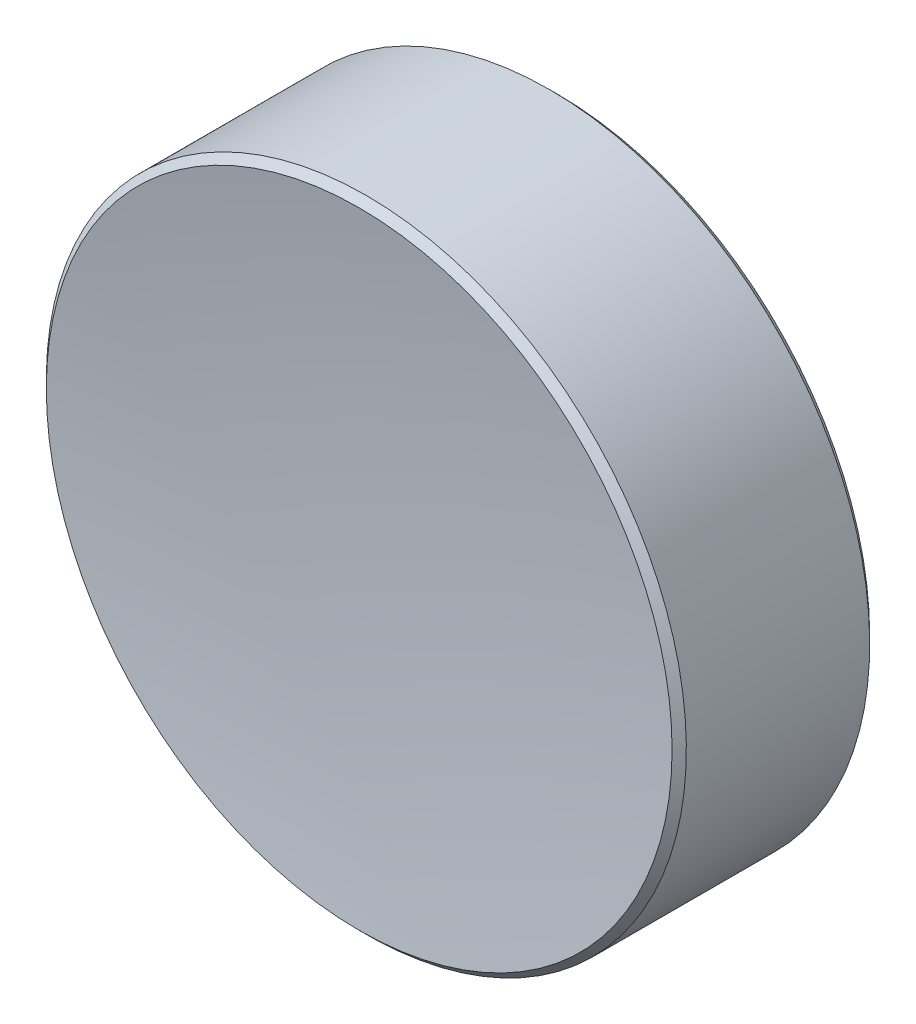
ISO-10303-21;
HEADER;
FILE_DESCRIPTION(('STEP AP214'),'2;1');
FILE_NAME('part.step','',(''),(''),'','','');
FILE_SCHEMA(('AUTOMOTIVE_DESIGN { 1 0 10303 214 1 1 1 1 }'));
ENDSEC;
DATA;
#1=APPLICATION_CONTEXT('core data for automotive mechanical design processes');
#2=APPLICATION_PROTOCOL_DEFINITION('international standard','automotive_design',2000,#1);
#3=PRODUCT_CONTEXT('',#1,'mechanical');
#4=PRODUCT('Part','Part','',(#3));
#5=PRODUCT_RELATED_PRODUCT_CATEGORY('part','',(#4));
#6=PRODUCT_DEFINITION_FORMATION('','',#4);
#7=PRODUCT_DEFINITION_CONTEXT('part definition',#1,'design');
#8=PRODUCT_DEFINITION('design','',#6,#7);
#9=PRODUCT_DEFINITION_SHAPE('','',#8);
#10=(LENGTH_UNIT() NAMED_UNIT(*) SI_UNIT(.MILLI.,.METRE.));
#11=(NAMED_UNIT(*) PLANE_ANGLE_UNIT() SI_UNIT($,.RADIAN.));
#12=(NAMED_UNIT(*) SI_UNIT($,.STERADIAN.) SOLID_ANGLE_UNIT());
#13=UNCERTAINTY_MEASURE_WITH_UNIT(LENGTH_MEASURE(1.E-05),#10,'distance_accuracy_value','');
#14=(GEOMETRIC_REPRESENTATION_CONTEXT(3) GLOBAL_UNCERTAINTY_ASSIGNED_CONTEXT((#13)) GLOBAL_UNIT_ASSIGNED_CONTEXT((#10,
#11,#12)) REPRESENTATION_CONTEXT('',''));
#15=CARTESIAN_POINT('',(0.,0.,0.));
#16=DIRECTION('',(0.,0.,1.));
#17=DIRECTION('',(1.,0.,0.));
#18=AXIS2_PLACEMENT_3D('',#15,#16,#17);
#19=CARTESIAN_POINT('',(0.,0.,47.75));
#20=DIRECTION('',(0.,0.,-1.));
#21=DIRECTION('',(0.,1.,0.));
#22=AXIS2_PLACEMENT_3D('',#19,#20,#21);
#23=SPHERICAL_SURFACE('',#22,46.);
#24=CARTESIAN_POINT('',(0.,0.,2.17090883722874));
#25=DIRECTION('',(0.,0.,-1.));
#26=DIRECTION('',(0.,1.,0.));
#27=AXIS2_PLACEMENT_3D('',#24,#25,#26);
#28=CIRCLE('',#27,6.20857864376269);
#29=CARTESIAN_POINT('',(0.,6.20857864376269,2.17090883722874));
#30=VERTEX_POINT('',#29);
#31=EDGE_CURVE('E9',#30,#30,#28,.T.);
#32=ORIENTED_EDGE('',*,*,#31,.F.);
#33=EDGE_LOOP('',(#32));
#34=FACE_BOUND('',#33,.T.);
#35=ADVANCED_FACE('F13',(#34),#23,.F.);
#36=CARTESIAN_POINT('',(0.,0.,2.02948748099143));
#37=DIRECTION('',(0.,0.,-1.));
#38=DIRECTION('',(0.,1.,0.));
#39=AXIS2_PLACEMENT_3D('',#36,#37,#38);
#40=CONICAL_SURFACE('',#39,6.35,0.785398163397442);
#41=ORIENTED_EDGE('',*,*,#31,.T.);
#42=EDGE_LOOP('',(#41));
#43=FACE_BOUND('',#42,.T.);
#44=CARTESIAN_POINT('',(0.,0.,2.02948748099143));
#45=DIRECTION('',(0.,0.,-1.));
#46=DIRECTION('',(0.,1.,0.));
#47=AXIS2_PLACEMENT_3D('',#44,#45,#46);
#48=CIRCLE('',#47,6.35);
#49=CARTESIAN_POINT('',(0.,6.35,2.02948748099143));
#50=VERTEX_POINT('',#49);
#51=EDGE_CURVE('E19',#50,#50,#48,.T.);
#52=ORIENTED_EDGE('',*,*,#51,.F.);
#53=EDGE_LOOP('',(#52));
#54=FACE_BOUND('',#53,.T.);
#55=ADVANCED_FACE('F47',(#43,#54),#40,.T.);
#56=CARTESIAN_POINT('',(0.,0.,-1.75));
#57=DIRECTION('',(0.,0.,-1.));
#58=DIRECTION('',(0.,1.,0.));
#59=AXIS2_PLACEMENT_3D('',#56,#57,#58);
#60=CYLINDRICAL_SURFACE('',#59,6.35);
#61=ORIENTED_EDGE('',*,*,#51,.T.);
#62=EDGE_LOOP('',(#61));
#63=FACE_BOUND('',#62,.T.);
#64=CARTESIAN_POINT('',(0.,0.,-1.60857864376269));
#65=DIRECTION('',(0.,0.,-1.));
#66=DIRECTION('',(0.,1.,0.));
#67=AXIS2_PLACEMENT_3D('',#64,#65,#66);
#68=CIRCLE('',#67,6.35);
#69=CARTESIAN_POINT('',(0.,6.35,-1.60857864376269));
#70=VERTEX_POINT('',#69);
#71=EDGE_CURVE('E23',#70,#70,#68,.T.);
#72=ORIENTED_EDGE('',*,*,#71,.F.);
#73=EDGE_LOOP('',(#72));
#74=FACE_BOUND('',#73,.T.);
#75=ADVANCED_FACE('F37',(#63,#74),#60,.T.);
#76=CARTESIAN_POINT('',(0.,0.,-1.75));
#77=DIRECTION('',(0.,0.,1.));
#78=DIRECTION('',(0.,-1.,0.));
#79=AXIS2_PLACEMENT_3D('',#76,#77,#78);
#80=CONICAL_SURFACE('',#79,6.20857864376269,0.785398163397449);
#81=ORIENTED_EDGE('',*,*,#71,.T.);
#82=EDGE_LOOP('',(#81));
#83=FACE_BOUND('',#82,.T.);
#84=CARTESIAN_POINT('',(0.,0.,-1.75));
#85=DIRECTION('',(0.,0.,-1.));
#86=DIRECTION('',(0.,1.,0.));
#87=AXIS2_PLACEMENT_3D('',#84,#85,#86);
#88=CIRCLE('',#87,6.20857864376269);
#89=CARTESIAN_POINT('',(0.,6.20857864376269,-1.75));
#90=VERTEX_POINT('',#89);
#91=EDGE_CURVE('E27',#90,#90,#88,.T.);
#92=ORIENTED_EDGE('',*,*,#91,.F.);
#93=EDGE_LOOP('',(#92));
#94=FACE_BOUND('',#93,.T.);
#95=ADVANCED_FACE('F35',(#83,#94),#80,.T.);
#96=CARTESIAN_POINT('',(0.,0.,-1.75));
#97=DIRECTION('',(0.,0.,-1.));
#98=DIRECTION('',(0.,1.,0.));
#99=AXIS2_PLACEMENT_3D('',#96,#97,#98);
#100=PLANE('',#99);
#101=ORIENTED_EDGE('',*,*,#91,.T.);
#102=EDGE_LOOP('',(#101));
#103=FACE_BOUND('',#102,.T.);
#104=ADVANCED_FACE('F33',(#103),#100,.T.);
#105=CLOSED_SHELL('',(#35,#55,#75,#95,#104));
#106=MANIFOLD_SOLID_BREP('B1',#105);
#107=ADVANCED_BREP_SHAPE_REPRESENTATION('',(#18,#106),#14);
#108=SHAPE_DEFINITION_REPRESENTATION(#9,#107);
ENDSEC;
END-ISO-10303-21;
